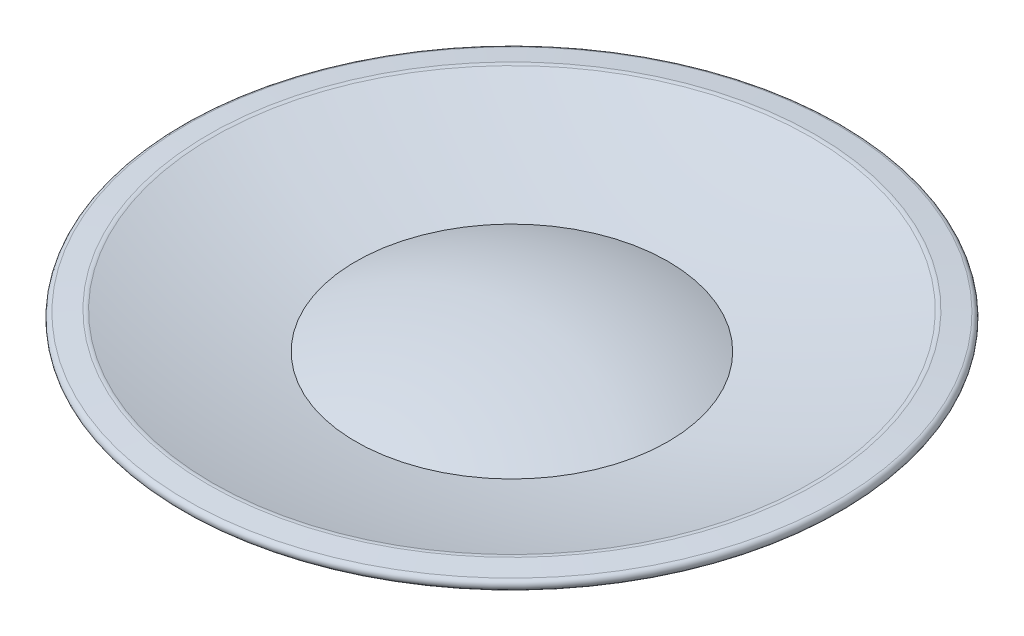
ISO-10303-21;
HEADER;
FILE_DESCRIPTION(('STEP AP214'),'2;1');
FILE_NAME('part.step','',(''),(''),'','','');
FILE_SCHEMA(('AUTOMOTIVE_DESIGN { 1 0 10303 214 1 1 1 1 }'));
ENDSEC;
DATA;
#1=APPLICATION_CONTEXT('core data for automotive mechanical design processes');
#2=APPLICATION_PROTOCOL_DEFINITION('international standard','automotive_design',2000,#1);
#3=PRODUCT_CONTEXT('',#1,'mechanical');
#4=PRODUCT('Part','Part','',(#3));
#5=PRODUCT_RELATED_PRODUCT_CATEGORY('part','',(#4));
#6=PRODUCT_DEFINITION_FORMATION('','',#4);
#7=PRODUCT_DEFINITION_CONTEXT('part definition',#1,'design');
#8=PRODUCT_DEFINITION('design','',#6,#7);
#9=PRODUCT_DEFINITION_SHAPE('','',#8);
#10=(LENGTH_UNIT() NAMED_UNIT(*) SI_UNIT(.MILLI.,.METRE.));
#11=(NAMED_UNIT(*) PLANE_ANGLE_UNIT() SI_UNIT($,.RADIAN.));
#12=(NAMED_UNIT(*) SI_UNIT($,.STERADIAN.) SOLID_ANGLE_UNIT());
#13=UNCERTAINTY_MEASURE_WITH_UNIT(LENGTH_MEASURE(1.E-05),#10,'distance_accuracy_value','');
#14=(GEOMETRIC_REPRESENTATION_CONTEXT(3) GLOBAL_UNCERTAINTY_ASSIGNED_CONTEXT((#13)) GLOBAL_UNIT_ASSIGNED_CONTEXT((#10,
#11,#12)) REPRESENTATION_CONTEXT('',''));
#15=CARTESIAN_POINT('',(0.,0.,0.));
#16=DIRECTION('',(0.,0.,1.));
#17=DIRECTION('',(1.,0.,0.));
#18=AXIS2_PLACEMENT_3D('',#15,#16,#17);
#19=CARTESIAN_POINT('',(-1.5,0.,0.));
#20=DIRECTION('',(0.,1.,0.));
#21=DIRECTION('',(0.,0.,1.));
#22=AXIS2_PLACEMENT_3D('',#19,#20,#21);
#23=PLANE('',#22);
#24=CARTESIAN_POINT('',(0.,0.,0.));
#25=DIRECTION('',(0.,-1.,0.));
#26=DIRECTION('',(0.,0.,-1.));
#27=AXIS2_PLACEMENT_3D('',#24,#25,#26);
#28=CIRCLE('',#27,1.43749999999998);
#29=CARTESIAN_POINT('',(0.,0.,-1.43749999999998));
#30=VERTEX_POINT('',#29);
#31=EDGE_CURVE('E10',#30,#30,#28,.T.);
#32=ORIENTED_EDGE('',*,*,#31,.F.);
#33=EDGE_LOOP('',(#32));
#34=FACE_BOUND('',#33,.T.);
#35=CARTESIAN_POINT('',(0.,0.,0.));
#36=DIRECTION('',(0.,-1.,0.));
#37=DIRECTION('',(0.,0.,-1.));
#38=AXIS2_PLACEMENT_3D('',#35,#36,#37);
#39=CIRCLE('',#38,1.5);
#40=CARTESIAN_POINT('',(0.,0.,-1.5));
#41=VERTEX_POINT('',#40);
#42=EDGE_CURVE('E59',#41,#41,#39,.T.);
#43=ORIENTED_EDGE('',*,*,#42,.T.);
#44=EDGE_LOOP('',(#43));
#45=FACE_BOUND('',#44,.T.);
#46=ADVANCED_FACE('F28',(#34,#45),#23,.F.);
#47=CARTESIAN_POINT('',(0.,0.,0.));
#48=DIRECTION('',(0.,-1.,0.));
#49=DIRECTION('',(0.,0.,-1.));
#50=AXIS2_PLACEMENT_3D('',#47,#48,#49);
#51=CYLINDRICAL_SURFACE('',#50,1.43749999999999);
#52=CARTESIAN_POINT('',(0.,1.,0.));
#53=DIRECTION('',(0.,-1.,0.));
#54=DIRECTION('',(0.,0.,-1.));
#55=AXIS2_PLACEMENT_3D('',#52,#53,#54);
#56=CIRCLE('',#55,1.4375);
#57=CARTESIAN_POINT('',(0.,1.,-1.4375));
#58=VERTEX_POINT('',#57);
#59=EDGE_CURVE('E34',#58,#58,#56,.T.);
#60=ORIENTED_EDGE('',*,*,#59,.F.);
#61=EDGE_LOOP('',(#60));
#62=FACE_BOUND('',#61,.T.);
#63=ORIENTED_EDGE('',*,*,#31,.T.);
#64=EDGE_LOOP('',(#63));
#65=FACE_BOUND('',#64,.T.);
#66=ADVANCED_FACE('F107',(#62,#65),#51,.F.);
#67=CARTESIAN_POINT('',(-1.4375,1.,0.));
#68=DIRECTION('',(0.,1.,0.));
#69=DIRECTION('',(0.,0.,1.));
#70=AXIS2_PLACEMENT_3D('',#67,#68,#69);
#71=PLANE('',#70);
#72=ORIENTED_EDGE('',*,*,#59,.T.);
#73=EDGE_LOOP('',(#72));
#74=FACE_BOUND('',#73,.T.);
#75=ADVANCED_FACE('F102',(#74),#71,.F.);
#76=CARTESIAN_POINT('',(0.,-3.25,0.));
#77=DIRECTION('',(0.,-1.,0.));
#78=DIRECTION('',(1.,0.,0.));
#79=AXIS2_PLACEMENT_3D('',#76,#77,#78);
#80=SPHERICAL_SURFACE('',#79,5.25);
#81=CARTESIAN_POINT('',(0.,1.592238444225,0.));
#82=DIRECTION('',(0.,-1.,0.));
#83=DIRECTION('',(0.,0.,-1.));
#84=AXIS2_PLACEMENT_3D('',#81,#82,#83);
#85=CIRCLE('',#84,2.02860219098507);
#86=CARTESIAN_POINT('',(0.,1.592238444225,-2.02860219098507));
#87=VERTEX_POINT('',#86);
#88=EDGE_CURVE('E38',#87,#87,#85,.T.);
#89=ORIENTED_EDGE('',*,*,#88,.F.);
#90=EDGE_LOOP('',(#89));
#91=FACE_BOUND('',#90,.T.);
#92=ADVANCED_FACE('F97',(#91),#80,.T.);
#93=CARTESIAN_POINT('',(0.,17.0746335383914,0.));
#94=DIRECTION('',(0.,-1.,0.));
#95=DIRECTION('',(0.,0.,-1.));
#96=AXIS2_PLACEMENT_3D('',#93,#94,#95);
#97=DEGENERATE_TOROIDAL_SURFACE('',#96,0.862408384597853,15.75,.F.);
#98=CARTESIAN_POINT('',(0.,2.05867282101406,0.));
#99=DIRECTION('',(0.,-1.,0.));
#100=DIRECTION('',(0.,0.,-1.));
#101=AXIS2_PLACEMENT_3D('',#98,#99,#100);
#102=CIRCLE('',#101,3.88979360334215);
#103=CARTESIAN_POINT('',(0.,2.05867282101406,-3.88979360334215));
#104=VERTEX_POINT('',#103);
#105=EDGE_CURVE('E42',#104,#104,#102,.T.);
#106=ORIENTED_EDGE('',*,*,#105,.F.);
#107=EDGE_LOOP('',(#106));
#108=FACE_BOUND('',#107,.T.);
#109=ORIENTED_EDGE('',*,*,#88,.T.);
#110=EDGE_LOOP('',(#109));
#111=FACE_BOUND('',#110,.T.);
#112=ADVANCED_FACE('F91',(#108,#111),#97,.T.);
#113=CARTESIAN_POINT('',(0.,1.93949852960631,0.));
#114=DIRECTION('',(0.,-1.,0.));
#115=DIRECTION('',(0.,0.,-1.));
#116=AXIS2_PLACEMENT_3D('',#113,#114,#115);
#117=TOROIDAL_SURFACE('',#116,3.92750949213532,0.125000000000002);
#118=CARTESIAN_POINT('',(0.,2.06369300400299,0.));
#119=DIRECTION('',(0.,-1.,0.));
#120=DIRECTION('',(0.,0.,-1.));
#121=AXIS2_PLACEMENT_3D('',#118,#119,#120);
#122=CIRCLE('',#121,3.9416775029107);
#123=CARTESIAN_POINT('',(0.,2.06369300400299,-3.9416775029107));
#124=VERTEX_POINT('',#123);
#125=EDGE_CURVE('E47',#124,#124,#122,.T.);
#126=ORIENTED_EDGE('',*,*,#125,.F.);
#127=EDGE_LOOP('',(#126));
#128=FACE_BOUND('',#127,.T.);
#129=ORIENTED_EDGE('',*,*,#105,.T.);
#130=EDGE_LOOP('',(#129));
#131=FACE_BOUND('',#130,.T.);
#132=ADVANCED_FACE('F85',(#128,#131),#117,.T.);
#133=CARTESIAN_POINT('',(0.,2.06369300400299,0.));
#134=DIRECTION('',(0.,-1.,0.));
#135=DIRECTION('',(0.,0.,-1.));
#136=AXIS2_PLACEMENT_3D('',#133,#134,#135);
#137=CONICAL_SURFACE('',#136,3.9416775029107,1.45720814042746);
#138=CARTESIAN_POINT('',(0.,2.03118451512492,0.));
#139=DIRECTION('',(0.,-1.,0.));
#140=DIRECTION('',(0.,0.,-1.));
#141=AXIS2_PLACEMENT_3D('',#138,#139,#140);
#142=CIRCLE('',#141,4.22664162057352);
#143=CARTESIAN_POINT('',(0.,2.03118451512492,-4.22664162057352));
#144=VERTEX_POINT('',#143);
#145=EDGE_CURVE('E50',#144,#144,#142,.T.);
#146=ORIENTED_EDGE('',*,*,#145,.F.);
#147=EDGE_LOOP('',(#146));
#148=FACE_BOUND('',#147,.T.);
#149=ORIENTED_EDGE('',*,*,#125,.T.);
#150=EDGE_LOOP('',(#149));
#151=FACE_BOUND('',#150,.T.);
#152=ADVANCED_FACE('F79',(#148,#151),#137,.T.);
#153=CARTESIAN_POINT('',(0.,1.96908727792658,0.));
#154=DIRECTION('',(0.,-1.,0.));
#155=DIRECTION('',(0.,0.,-1.));
#156=AXIS2_PLACEMENT_3D('',#153,#154,#155);
#157=TOROIDAL_SURFACE('',#156,4.21955761518583,0.062500000000001);
#158=CARTESIAN_POINT('',(0.,1.90984984161103,0.));
#159=DIRECTION('',(0.,-1.,0.));
#160=DIRECTION('',(0.,0.,-1.));
#161=AXIS2_PLACEMENT_3D('',#158,#159,#160);
#162=CIRCLE('',#161,4.23948689361635);
#163=CARTESIAN_POINT('',(0.,1.90984984161103,-4.23948689361635));
#164=VERTEX_POINT('',#163);
#165=EDGE_CURVE('E53',#164,#164,#162,.T.);
#166=ORIENTED_EDGE('',*,*,#165,.F.);
#167=EDGE_LOOP('',(#166));
#168=FACE_BOUND('',#167,.T.);
#169=ORIENTED_EDGE('',*,*,#145,.T.);
#170=EDGE_LOOP('',(#169));
#171=FACE_BOUND('',#170,.T.);
#172=ADVANCED_FACE('F73',(#168,#171),#157,.T.);
#173=CARTESIAN_POINT('',(0.,17.0746335383914,0.));
#174=DIRECTION('',(0.,-1.,0.));
#175=DIRECTION('',(0.,0.,-1.));
#176=AXIS2_PLACEMENT_3D('',#173,#174,#175);
#177=DEGENERATE_TOROIDAL_SURFACE('',#176,0.862408384597853,16.,.F.);
#178=CARTESIAN_POINT('',(0.,1.25,0.));
#179=DIRECTION('',(0.,-1.,0.));
#180=DIRECTION('',(0.,0.,-1.));
#181=AXIS2_PLACEMENT_3D('',#178,#179,#180);
#182=CIRCLE('',#181,1.5);
#183=CARTESIAN_POINT('',(0.,1.25,-1.5));
#184=VERTEX_POINT('',#183);
#185=EDGE_CURVE('E56',#184,#184,#182,.T.);
#186=ORIENTED_EDGE('',*,*,#185,.F.);
#187=EDGE_LOOP('',(#186));
#188=FACE_BOUND('',#187,.T.);
#189=ORIENTED_EDGE('',*,*,#165,.T.);
#190=EDGE_LOOP('',(#189));
#191=FACE_BOUND('',#190,.T.);
#192=ADVANCED_FACE('F67',(#188,#191),#177,.F.);
#193=CARTESIAN_POINT('',(0.,0.,0.));
#194=DIRECTION('',(0.,-1.,0.));
#195=DIRECTION('',(0.,0.,-1.));
#196=AXIS2_PLACEMENT_3D('',#193,#194,#195);
#197=CYLINDRICAL_SURFACE('',#196,1.5);
#198=ORIENTED_EDGE('',*,*,#42,.F.);
#199=EDGE_LOOP('',(#198));
#200=FACE_BOUND('',#199,.T.);
#201=ORIENTED_EDGE('',*,*,#185,.T.);
#202=EDGE_LOOP('',(#201));
#203=FACE_BOUND('',#202,.T.);
#204=ADVANCED_FACE('F64',(#200,#203),#197,.T.);
#205=CLOSED_SHELL('',(#46,#66,#75,#92,#112,#132,#152,#172,#192,#204));
#206=MANIFOLD_SOLID_BREP('B2',#205);
#207=ADVANCED_BREP_SHAPE_REPRESENTATION('',(#18,#206),#14);
#208=SHAPE_DEFINITION_REPRESENTATION(#9,#207);
ENDSEC;
END-ISO-10303-21;
